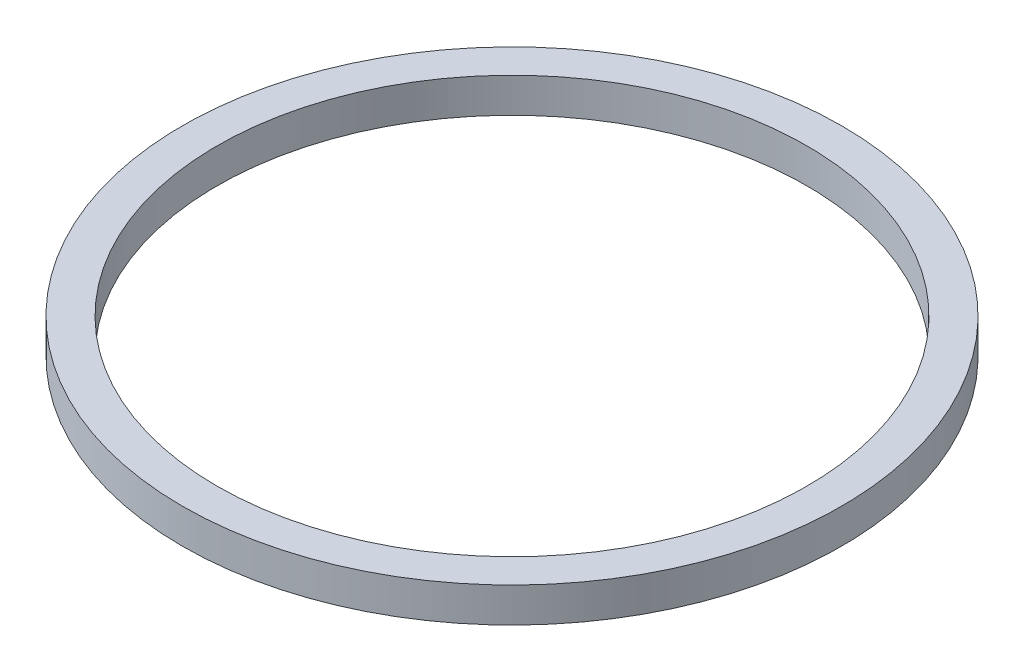
ISO-10303-21;
HEADER;
FILE_DESCRIPTION(('STEP AP214'),'2;1');
FILE_NAME('part.step','',(''),(''),'','','');
FILE_SCHEMA(('AUTOMOTIVE_DESIGN { 1 0 10303 214 1 1 1 1 }'));
ENDSEC;
DATA;
#1=APPLICATION_CONTEXT('core data for automotive mechanical design processes');
#2=APPLICATION_PROTOCOL_DEFINITION('international standard','automotive_design',2000,#1);
#3=PRODUCT_CONTEXT('',#1,'mechanical');
#4=PRODUCT('Part','Part','',(#3));
#5=PRODUCT_RELATED_PRODUCT_CATEGORY('part','',(#4));
#6=PRODUCT_DEFINITION_FORMATION('','',#4);
#7=PRODUCT_DEFINITION_CONTEXT('part definition',#1,'design');
#8=PRODUCT_DEFINITION('design','',#6,#7);
#9=PRODUCT_DEFINITION_SHAPE('','',#8);
#10=(LENGTH_UNIT() NAMED_UNIT(*) SI_UNIT(.MILLI.,.METRE.));
#11=(NAMED_UNIT(*) PLANE_ANGLE_UNIT() SI_UNIT($,.RADIAN.));
#12=(NAMED_UNIT(*) SI_UNIT($,.STERADIAN.) SOLID_ANGLE_UNIT());
#13=UNCERTAINTY_MEASURE_WITH_UNIT(LENGTH_MEASURE(1.E-05),#10,'distance_accuracy_value','');
#14=(GEOMETRIC_REPRESENTATION_CONTEXT(3) GLOBAL_UNCERTAINTY_ASSIGNED_CONTEXT((#13)) GLOBAL_UNIT_ASSIGNED_CONTEXT((#10,
#11,#12)) REPRESENTATION_CONTEXT('',''));
#15=CARTESIAN_POINT('',(0.,0.,0.));
#16=DIRECTION('',(0.,0.,1.));
#17=DIRECTION('',(1.,0.,0.));
#18=AXIS2_PLACEMENT_3D('',#15,#16,#17);
#19=CARTESIAN_POINT('',(0.,1.,0.));
#20=DIRECTION('',(0.,1.,0.));
#21=DIRECTION('',(0.,0.,1.));
#22=AXIS2_PLACEMENT_3D('',#19,#20,#21);
#23=PLANE('',#22);
#24=CARTESIAN_POINT('',(0.,1.,0.));
#25=DIRECTION('',(0.,1.,0.));
#26=DIRECTION('',(0.,0.,1.));
#27=AXIS2_PLACEMENT_3D('',#24,#25,#26);
#28=CIRCLE('',#27,9.5);
#29=CARTESIAN_POINT('',(0.,1.,9.5));
#30=VERTEX_POINT('',#29);
#31=EDGE_CURVE('E10',#30,#30,#28,.T.);
#32=ORIENTED_EDGE('',*,*,#31,.T.);
#33=EDGE_LOOP('',(#32));
#34=FACE_BOUND('',#33,.T.);
#35=CARTESIAN_POINT('',(0.,1.,0.));
#36=DIRECTION('',(0.,1.,0.));
#37=DIRECTION('',(0.,0.,1.));
#38=AXIS2_PLACEMENT_3D('',#35,#36,#37);
#39=CIRCLE('',#38,8.5);
#40=CARTESIAN_POINT('',(0.,1.,8.5));
#41=VERTEX_POINT('',#40);
#42=EDGE_CURVE('E56',#41,#41,#39,.T.);
#43=ORIENTED_EDGE('',*,*,#42,.F.);
#44=EDGE_LOOP('',(#43));
#45=FACE_BOUND('',#44,.T.);
#46=ADVANCED_FACE('F43',(#34,#45),#23,.T.);
#47=CARTESIAN_POINT('',(0.,0.,0.));
#48=DIRECTION('',(0.,1.,0.));
#49=DIRECTION('',(0.,0.,1.));
#50=AXIS2_PLACEMENT_3D('',#47,#48,#49);
#51=PLANE('',#50);
#52=CARTESIAN_POINT('',(0.,0.,0.));
#53=DIRECTION('',(0.,1.,0.));
#54=DIRECTION('',(0.,0.,1.));
#55=AXIS2_PLACEMENT_3D('',#52,#53,#54);
#56=CIRCLE('',#55,9.5);
#57=CARTESIAN_POINT('',(0.,0.,9.5));
#58=VERTEX_POINT('',#57);
#59=EDGE_CURVE('E47',#58,#58,#56,.T.);
#60=ORIENTED_EDGE('',*,*,#59,.F.);
#61=EDGE_LOOP('',(#60));
#62=FACE_BOUND('',#61,.T.);
#63=CARTESIAN_POINT('',(0.,0.,0.));
#64=DIRECTION('',(0.,1.,0.));
#65=DIRECTION('',(0.,0.,1.));
#66=AXIS2_PLACEMENT_3D('',#63,#64,#65);
#67=CIRCLE('',#66,8.5);
#68=CARTESIAN_POINT('',(0.,0.,8.5));
#69=VERTEX_POINT('',#68);
#70=EDGE_CURVE('E58',#69,#69,#67,.T.);
#71=ORIENTED_EDGE('',*,*,#70,.T.);
#72=EDGE_LOOP('',(#71));
#73=FACE_BOUND('',#72,.T.);
#74=ADVANCED_FACE('F70',(#62,#73),#51,.F.);
#75=CARTESIAN_POINT('',(0.,1.,0.));
#76=DIRECTION('',(0.,-1.,0.));
#77=DIRECTION('',(0.,0.,-1.));
#78=AXIS2_PLACEMENT_3D('',#75,#76,#77);
#79=CYLINDRICAL_SURFACE('',#78,9.5);
#80=ORIENTED_EDGE('',*,*,#31,.F.);
#81=EDGE_LOOP('',(#80));
#82=FACE_BOUND('',#81,.T.);
#83=ORIENTED_EDGE('',*,*,#59,.T.);
#84=EDGE_LOOP('',(#83));
#85=FACE_BOUND('',#84,.T.);
#86=ADVANCED_FACE('F45',(#82,#85),#79,.T.);
#87=CARTESIAN_POINT('',(0.,1.,0.));
#88=DIRECTION('',(0.,-1.,0.));
#89=DIRECTION('',(0.,0.,-1.));
#90=AXIS2_PLACEMENT_3D('',#87,#88,#89);
#91=CYLINDRICAL_SURFACE('',#90,8.5);
#92=ORIENTED_EDGE('',*,*,#42,.T.);
#93=EDGE_LOOP('',(#92));
#94=FACE_BOUND('',#93,.T.);
#95=ORIENTED_EDGE('',*,*,#70,.F.);
#96=EDGE_LOOP('',(#95));
#97=FACE_BOUND('',#96,.T.);
#98=ADVANCED_FACE('F66',(#94,#97),#91,.F.);
#99=CLOSED_SHELL('',(#46,#74,#86,#98));
#100=MANIFOLD_SOLID_BREP('B2',#99);
#101=ADVANCED_BREP_SHAPE_REPRESENTATION('',(#18,#100),#14);
#102=SHAPE_DEFINITION_REPRESENTATION(#9,#101);
ENDSEC;
END-ISO-10303-21;
